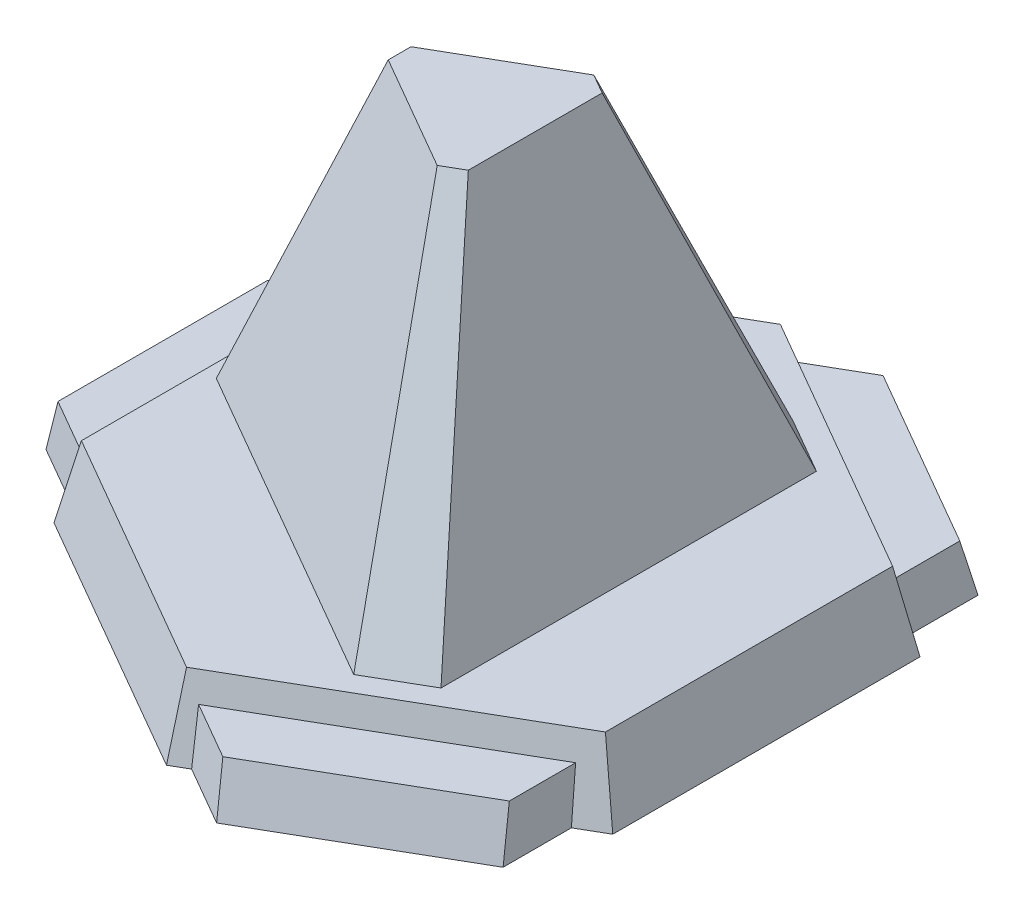
ISO-10303-21;
HEADER;
FILE_DESCRIPTION(('STEP AP214'),'2;1');
FILE_NAME('part.step','',(''),(''),'','','');
FILE_SCHEMA(('AUTOMOTIVE_DESIGN { 1 0 10303 214 1 1 1 1 }'));
ENDSEC;
DATA;
#1=APPLICATION_CONTEXT('core data for automotive mechanical design processes');
#2=APPLICATION_PROTOCOL_DEFINITION('international standard','automotive_design',2000,#1);
#3=PRODUCT_CONTEXT('',#1,'mechanical');
#4=PRODUCT('Part','Part','',(#3));
#5=PRODUCT_RELATED_PRODUCT_CATEGORY('part','',(#4));
#6=PRODUCT_DEFINITION_FORMATION('','',#4);
#7=PRODUCT_DEFINITION_CONTEXT('part definition',#1,'design');
#8=PRODUCT_DEFINITION('design','',#6,#7);
#9=PRODUCT_DEFINITION_SHAPE('','',#8);
#10=(LENGTH_UNIT() NAMED_UNIT(*) SI_UNIT(.MILLI.,.METRE.));
#11=(NAMED_UNIT(*) PLANE_ANGLE_UNIT() SI_UNIT($,.RADIAN.));
#12=(NAMED_UNIT(*) SI_UNIT($,.STERADIAN.) SOLID_ANGLE_UNIT());
#13=UNCERTAINTY_MEASURE_WITH_UNIT(LENGTH_MEASURE(1.E-05),#10,'distance_accuracy_value','');
#14=(GEOMETRIC_REPRESENTATION_CONTEXT(3) GLOBAL_UNCERTAINTY_ASSIGNED_CONTEXT((#13)) GLOBAL_UNIT_ASSIGNED_CONTEXT((#10,
#11,#12)) REPRESENTATION_CONTEXT('',''));
#15=CARTESIAN_POINT('',(0.,0.,0.));
#16=DIRECTION('',(0.,0.,1.));
#17=DIRECTION('',(1.,0.,0.));
#18=AXIS2_PLACEMENT_3D('',#15,#16,#17);
#19=CARTESIAN_POINT('',(0.,200.,0.));
#20=DIRECTION('',(0.,1.,0.));
#21=DIRECTION('',(0.,0.,1.));
#22=AXIS2_PLACEMENT_3D('',#19,#20,#21);
#23=PLANE('',#22);
#24=DIRECTION('',(-0.866021880362492,0.,-0.500006102696171));
#25=VECTOR('',#24,1.);
#26=CARTESIAN_POINT('',(709.540386799793,200.,-383.635));
#27=LINE('',#26,#25);
#28=CARTESIAN_POINT('',(709.540386799793,200.,-383.635));
#29=VERTEX_POINT('',#28);
#30=CARTESIAN_POINT('',(0.,200.,-793.295));
#31=VERTEX_POINT('',#30);
#32=EDGE_CURVE('E689',#29,#31,#27,.T.);
#33=ORIENTED_EDGE('',*,*,#32,.T.);
#34=DIRECTION('',(-0.866021641384725,0.,0.500006516610841));
#35=VECTOR('',#34,1.);
#36=CARTESIAN_POINT('',(0.,200.,-793.295));
#37=LINE('',#36,#35);
#38=CARTESIAN_POINT('',(-664.472424785258,200.,-409.655));
#39=VERTEX_POINT('',#38);
#40=EDGE_CURVE('E670',#31,#39,#37,.T.);
#41=ORIENTED_EDGE('',*,*,#40,.T.);
#42=DIRECTION('',(0.,0.,1.));
#43=VECTOR('',#42,1.);
#44=CARTESIAN_POINT('',(-664.472424785258,200.,-409.655));
#45=LINE('',#44,#43);
#46=CARTESIAN_POINT('',(-664.472424785258,200.,409.655));
#47=VERTEX_POINT('',#46);
#48=EDGE_CURVE('E815',#39,#47,#45,.T.);
#49=ORIENTED_EDGE('',*,*,#48,.T.);
#50=DIRECTION('',(0.866021641384725,0.,0.500006516610841));
#51=VECTOR('',#50,1.);
#52=CARTESIAN_POINT('',(-664.472424785258,200.,409.655));
#53=LINE('',#52,#51);
#54=CARTESIAN_POINT('',(0.,200.,793.295));
#55=VERTEX_POINT('',#54);
#56=EDGE_CURVE('E819',#47,#55,#53,.T.);
#57=ORIENTED_EDGE('',*,*,#56,.T.);
#58=DIRECTION('',(0.866021880362492,0.,-0.500006102696171));
#59=VECTOR('',#58,1.);
#60=CARTESIAN_POINT('',(0.,200.,793.295));
#61=LINE('',#60,#59);
#62=CARTESIAN_POINT('',(709.540386799793,200.,383.635));
#63=VERTEX_POINT('',#62);
#64=EDGE_CURVE('E679',#55,#63,#61,.T.);
#65=ORIENTED_EDGE('',*,*,#64,.T.);
#66=DIRECTION('',(0.,0.,-1.));
#67=VECTOR('',#66,1.);
#68=CARTESIAN_POINT('',(709.540386799793,200.,383.635));
#69=LINE('',#68,#67);
#70=EDGE_CURVE('E675',#63,#29,#69,.T.);
#71=ORIENTED_EDGE('',*,*,#70,.T.);
#72=EDGE_LOOP('',(#33,#41,#49,#57,#65,#71));
#73=FACE_BOUND('',#72,.T.);
#74=DIRECTION('',(0.,0.,1.));
#75=VECTOR('',#74,1.);
#76=CARTESIAN_POINT('',(-628.390648589845,200.,85.3266133395101));
#77=LINE('',#76,#75);
#78=CARTESIAN_POINT('',(-628.390648589845,200.,-85.3333866604898));
#79=VERTEX_POINT('',#78);
#80=CARTESIAN_POINT('',(-628.390648589845,200.,85.3266133395101));
#81=VERTEX_POINT('',#80);
#82=EDGE_CURVE('E349',#79,#81,#77,.T.);
#83=ORIENTED_EDGE('',*,*,#82,.F.);
#84=DIRECTION('',(-0.866024804325613,0.,0.500001038291707));
#85=VECTOR('',#84,1.);
#86=CARTESIAN_POINT('',(-628.390648589845,200.,-85.3333866604898));
#87=LINE('',#86,#85);
#88=CARTESIAN_POINT('',(240.30151213309,200.,-586.874428150135));
#89=VERTEX_POINT('',#88);
#90=EDGE_CURVE('E1160',#89,#79,#87,.T.);
#91=ORIENTED_EDGE('',*,*,#90,.F.);
#92=DIRECTION('',(-0.866025403784436,0.,-0.500000000000004));
#93=VECTOR('',#92,1.);
#94=CARTESIAN_POINT('',(240.30151213309,200.,-586.874428150135));
#95=LINE('',#94,#93);
#96=CARTESIAN_POINT('',(388.097407542942,200.,-501.544428150134));
#97=VERTEX_POINT('',#96);
#98=EDGE_CURVE('E1157',#97,#89,#95,.T.);
#99=ORIENTED_EDGE('',*,*,#98,.F.);
#100=DIRECTION('',(0.,0.,-1.));
#101=VECTOR('',#100,1.);
#102=CARTESIAN_POINT('',(388.097407542942,200.,-501.544428150134));
#103=LINE('',#102,#101);
#104=CARTESIAN_POINT('',(388.097407542942,200.,501.535571849866));
#105=VERTEX_POINT('',#104);
#106=EDGE_CURVE('E255',#105,#97,#103,.T.);
#107=ORIENTED_EDGE('',*,*,#106,.F.);
#108=DIRECTION('',(0.866021880362492,0.,-0.500006102696171));
#109=VECTOR('',#108,1.);
#110=CARTESIAN_POINT('',(388.097407542942,200.,501.535571849866));
#111=LINE('',#110,#109);
#112=CARTESIAN_POINT('',(240.302113440279,200.,586.866613335994));
#113=VERTEX_POINT('',#112);
#114=EDGE_CURVE('E1153',#113,#105,#111,.T.);
#115=ORIENTED_EDGE('',*,*,#114,.F.);
#116=DIRECTION('',(0.866025403786462,0.,0.499999999996495));
#117=VECTOR('',#116,1.);
#118=CARTESIAN_POINT('',(240.302113440279,200.,586.866613335994));
#119=LINE('',#118,#117);
#120=EDGE_CURVE('E1146',#81,#113,#119,.T.);
#121=ORIENTED_EDGE('',*,*,#120,.F.);
#122=EDGE_LOOP('',(#83,#91,#99,#107,#115,#121));
#123=FACE_BOUND('',#122,.T.);
#124=ADVANCED_FACE('F84',(#73,#123),#23,.T.);
#125=CARTESIAN_POINT('',(0.,0.,0.));
#126=DIRECTION('',(0.,1.,0.));
#127=DIRECTION('',(0.,0.,1.));
#128=AXIS2_PLACEMENT_3D('',#125,#126,#127);
#129=PLANE('',#128);
#130=DIRECTION('',(0.866025403784434,0.,0.500000000000008));
#131=VECTOR('',#130,1.);
#132=CARTESIAN_POINT('',(20.0519421003271,0.,809.279324454482));
#133=LINE('',#132,#131);
#134=CARTESIAN_POINT('',(42.5929822518182,0.,822.29340005376));
#135=VERTEX_POINT('',#134);
#136=CARTESIAN_POINT('',(200.609578535344,0.,913.524324454484));
#137=VERTEX_POINT('',#136);
#138=EDGE_CURVE('E573',#135,#137,#133,.T.);
#139=ORIENTED_EDGE('',*,*,#138,.F.);
#140=DIRECTION('',(0.866021880362492,0.,-0.500006102696171));
#141=VECTOR('',#140,1.);
#142=CARTESIAN_POINT('',(-1.28066276541827E-05,0.,846.884877410448));
#143=LINE('',#142,#141);
#144=CARTESIAN_POINT('',(-1.28066276541827E-05,0.,846.884877410448));
#145=VERTEX_POINT('',#144);
#146=EDGE_CURVE('E558',#145,#135,#143,.T.);
#147=ORIENTED_EDGE('',*,*,#146,.F.);
#148=DIRECTION('',(0.866021641384725,0.,0.500006516610841));
#149=VECTOR('',#148,1.);
#150=CARTESIAN_POINT('',(-710.882424785258,0.,436.449593177819));
#151=LINE('',#150,#149);
#152=CARTESIAN_POINT('',(-710.882424785258,0.,436.449593177819));
#153=VERTEX_POINT('',#152);
#154=EDGE_CURVE('E559',#153,#145,#151,.T.);
#155=ORIENTED_EDGE('',*,*,#154,.F.);
#156=DIRECTION('',(0.,0.,1.));
#157=VECTOR('',#156,1.);
#158=CARTESIAN_POINT('',(-710.882424785258,0.,-436.449593177819));
#159=LINE('',#158,#157);
#160=CARTESIAN_POINT('',(-710.882424785258,0.,381.545829026863));
#161=VERTEX_POINT('',#160);
#162=EDGE_CURVE('E638',#161,#153,#159,.T.);
#163=ORIENTED_EDGE('',*,*,#162,.F.);
#164=DIRECTION('',(0.866025403784439,0.,0.5));
#165=VECTOR('',#164,1.);
#166=CARTESIAN_POINT('',(-891.440061220275,0.,277.300829026863));
#167=LINE('',#166,#165);
#168=CARTESIAN_POINT('',(-891.440061220275,0.,277.300829026863));
#169=VERTEX_POINT('',#168);
#170=EDGE_CURVE('E913',#169,#161,#167,.T.);
#171=ORIENTED_EDGE('',*,*,#170,.F.);
#172=DIRECTION('',(0.,0.,1.));
#173=VECTOR('',#172,1.);
#174=CARTESIAN_POINT('',(-891.440061220275,0.,-283.029170973137));
#175=LINE('',#174,#173);
#176=CARTESIAN_POINT('',(-891.440061220275,0.,-283.029170973137));
#177=VERTEX_POINT('',#176);
#178=EDGE_CURVE('E919',#177,#169,#175,.T.);
#179=ORIENTED_EDGE('',*,*,#178,.F.);
#180=DIRECTION('',(-0.866025403784439,0.,0.5));
#181=VECTOR('',#180,1.);
#182=CARTESIAN_POINT('',(-710.882424785258,0.,-387.274170973137));
#183=LINE('',#182,#181);
#184=CARTESIAN_POINT('',(-710.882424785258,0.,-387.274170973137));
#185=VERTEX_POINT('',#184);
#186=EDGE_CURVE('E915',#185,#177,#183,.T.);
#187=ORIENTED_EDGE('',*,*,#186,.F.);
#188=CARTESIAN_POINT('',(-710.882424785258,0.,-436.449593177819));
#189=VERTEX_POINT('',#188);
#190=EDGE_CURVE('E646',#189,#185,#159,.T.);
#191=ORIENTED_EDGE('',*,*,#190,.F.);
#192=DIRECTION('',(-0.866021641384725,0.,0.500006516610841));
#193=VECTOR('',#192,1.);
#194=CARTESIAN_POINT('',(-1.28066275431604E-05,0.,-846.884877410448));
#195=LINE('',#194,#193);
#196=CARTESIAN_POINT('',(-1.28066275431604E-05,0.,-846.884877410448));
#197=VERTEX_POINT('',#196);
#198=EDGE_CURVE('E632',#197,#189,#195,.T.);
#199=ORIENTED_EDGE('',*,*,#198,.F.);
#200=DIRECTION('',(-0.866021880362492,0.,-0.500006102696171));
#201=VECTOR('',#200,1.);
#202=CARTESIAN_POINT('',(755.950386799793,0.,-410.429607965514));
#203=LINE('',#202,#201);
#204=CARTESIAN_POINT('',(47.55383153254,0.,-819.429205775114));
#205=VERTEX_POINT('',#204);
#206=EDGE_CURVE('E620',#205,#197,#203,.T.);
#207=ORIENTED_EDGE('',*,*,#206,.F.);
#208=DIRECTION('',(-0.866025403784441,0.,0.499999999999996));
#209=VECTOR('',#208,1.);
#210=CARTESIAN_POINT('',(205.570468182393,0.,-910.660153481345));
#211=LINE('',#210,#209);
#212=CARTESIAN_POINT('',(205.570468182393,0.,-910.660153481345));
#213=VERTEX_POINT('',#212);
#214=EDGE_CURVE('E625',#213,#205,#211,.T.);
#215=ORIENTED_EDGE('',*,*,#214,.F.);
#216=DIRECTION('',(-0.866025403784436,0.,-0.500000000000004));
#217=VECTOR('',#216,1.);
#218=CARTESIAN_POINT('',(690.830482684926,0.,-630.495153481342));
#219=LINE('',#218,#217);
#220=CARTESIAN_POINT('',(690.830482684926,0.,-630.495153481342));
#221=VERTEX_POINT('',#220);
#222=EDGE_CURVE('E1000',#221,#213,#219,.T.);
#223=ORIENTED_EDGE('',*,*,#222,.F.);
#224=DIRECTION('',(0.,0.,-1.));
#225=VECTOR('',#224,1.);
#226=CARTESIAN_POINT('',(690.830482684925,0.,-422.005153481342));
#227=LINE('',#226,#225);
#228=CARTESIAN_POINT('',(690.830482684925,0.,-448.027213987656));
#229=VERTEX_POINT('',#228);
#230=EDGE_CURVE('E594',#229,#221,#227,.T.);
#231=ORIENTED_EDGE('',*,*,#230,.F.);
#232=CARTESIAN_POINT('',(755.950386799793,0.,-410.429607965514));
#233=VERTEX_POINT('',#232);
#234=EDGE_CURVE('E623',#233,#229,#203,.T.);
#235=ORIENTED_EDGE('',*,*,#234,.F.);
#236=DIRECTION('',(0.,0.,-1.));
#237=VECTOR('',#236,1.);
#238=CARTESIAN_POINT('',(755.950386799793,0.,410.429607965515));
#239=LINE('',#238,#237);
#240=CARTESIAN_POINT('',(755.950386799793,0.,410.429607965515));
#241=VERTEX_POINT('',#240);
#242=EDGE_CURVE('E568',#241,#233,#239,.T.);
#243=ORIENTED_EDGE('',*,*,#242,.F.);
#244=CARTESIAN_POINT('',(685.869593037883,0.,450.891431572188));
#245=VERTEX_POINT('',#244);
#246=EDGE_CURVE('E555',#245,#241,#143,.T.);
#247=ORIENTED_EDGE('',*,*,#246,.F.);
#248=DIRECTION('',(0.,0.,-1.));
#249=VECTOR('',#248,1.);
#250=CARTESIAN_POINT('',(685.869593037881,0.,633.359324454488));
#251=LINE('',#250,#249);
#252=CARTESIAN_POINT('',(685.869593037881,0.,633.359324454488));
#253=VERTEX_POINT('',#252);
#254=EDGE_CURVE('E560',#253,#245,#251,.T.);
#255=ORIENTED_EDGE('',*,*,#254,.F.);
#256=DIRECTION('',(0.866025403784443,0.,-0.499999999999992));
#257=VECTOR('',#256,1.);
#258=CARTESIAN_POINT('',(200.609578535344,0.,913.524324454484));
#259=LINE('',#258,#257);
#260=EDGE_CURVE('E529',#137,#253,#259,.T.);
#261=ORIENTED_EDGE('',*,*,#260,.F.);
#262=EDGE_LOOP('',(#139,#147,#155,#163,#171,#179,#187,#191,#199,#207,#215,#223,#231,#235,#243,
#247,#255,#261));
#263=FACE_BOUND('',#262,.T.);
#264=ADVANCED_FACE('F86',(#263),#129,.F.);
#265=CARTESIAN_POINT('',(-347.97748435265,161.494245697761,-602.704209150453));
#266=DIRECTION('',(-0.487064908399797,0.226043877908375,-0.843606507955955));
#267=DIRECTION('',(-0.866021641384725,0.,0.500006516610841));
#268=AXIS2_PLACEMENT_3D('',#265,#266,#267);
#269=PLANE('',#268);
#270=DIRECTION('',(-6.18512586886278E-08,-0.965925779291661,-0.25881922049916));
#271=VECTOR('',#270,1.);
#272=CARTESIAN_POINT('',(0.,200.,-793.295));
#273=LINE('',#272,#271);
#274=EDGE_CURVE('E667',#31,#197,#273,.T.);
#275=ORIENTED_EDGE('',*,*,#274,.T.);
#276=ORIENTED_EDGE('',*,*,#198,.T.);
#277=DIRECTION('',(-0.224143172858408,-0.965926192020722,-0.129407996774977));
#278=VECTOR('',#277,1.);
#279=CARTESIAN_POINT('',(-664.472424785258,200.,-409.655));
#280=LINE('',#279,#278);
#281=EDGE_CURVE('E674',#39,#189,#280,.T.);
#282=ORIENTED_EDGE('',*,*,#281,.F.);
#283=ORIENTED_EDGE('',*,*,#40,.F.);
#284=EDGE_LOOP('',(#275,#276,#282,#283));
#285=FACE_BOUND('',#284,.T.);
#286=ADVANCED_FACE('F668',(#285),#269,.T.);
#287=CARTESIAN_POINT('',(-674.559293888962,156.531484146933,0.));
#288=DIRECTION('',(-0.974117120915213,0.226043877908375,0.));
#289=DIRECTION('',(-0.226043877908375,-0.974117120915213,0.));
#290=AXIS2_PLACEMENT_3D('',#287,#288,#289);
#291=PLANE('',#290);
#292=DIRECTION('',(-0.225848374170278,-0.973274613963708,-0.0415816990806911));
#293=VECTOR('',#292,1.);
#294=CARTESIAN_POINT('',(-670.985144584048,171.933980612842,-379.928549356158));
#295=LINE('',#294,#293);
#296=CARTESIAN_POINT('',(-680.697360785258,130.08,-381.716697944647));
#297=VERTEX_POINT('',#296);
#298=EDGE_CURVE('E980',#297,#185,#295,.T.);
#299=ORIENTED_EDGE('',*,*,#298,.F.);
#300=DIRECTION('',(0.,0.,1.));
#301=VECTOR('',#300,1.);
#302=CARTESIAN_POINT('',(-680.697360785258,130.08,0.));
#303=LINE('',#302,#301);
#304=CARTESIAN_POINT('',(-680.697360785258,130.08,381.716697944648));
#305=VERTEX_POINT('',#304);
#306=EDGE_CURVE('E983',#297,#305,#303,.T.);
#307=ORIENTED_EDGE('',*,*,#306,.T.);
#308=DIRECTION('',(0.226043692858134,0.974116323456731,0.00127956797343759));
#309=VECTOR('',#308,1.);
#310=CARTESIAN_POINT('',(-674.669711016119,156.055650804305,381.750818726794));
#311=LINE('',#310,#309);
#312=EDGE_CURVE('E987',#161,#305,#311,.T.);
#313=ORIENTED_EDGE('',*,*,#312,.F.);
#314=ORIENTED_EDGE('',*,*,#162,.T.);
#315=DIRECTION('',(-0.224143172858408,-0.965926192020722,0.129407996774976));
#316=VECTOR('',#315,1.);
#317=CARTESIAN_POINT('',(-664.472424785258,200.,409.655));
#318=LINE('',#317,#316);
#319=EDGE_CURVE('E624',#47,#153,#318,.T.);
#320=ORIENTED_EDGE('',*,*,#319,.F.);
#321=ORIENTED_EDGE('',*,*,#48,.F.);
#322=ORIENTED_EDGE('',*,*,#281,.T.);
#323=ORIENTED_EDGE('',*,*,#190,.T.);
#324=EDGE_LOOP('',(#299,#307,#313,#314,#320,#321,#322,#323));
#325=FACE_BOUND('',#324,.T.);
#326=ADVANCED_FACE('F708',(#325),#291,.T.);
#327=CARTESIAN_POINT('',(347.977286238095,161.494287441961,-602.704531257433));
#328=DIRECTION('',(0.487064505198431,0.226043877908375,-0.843606740748289));
#329=DIRECTION('',(-0.866021880362492,0.,-0.500006102696171));
#330=AXIS2_PLACEMENT_3D('',#327,#328,#329);
#331=PLANE('',#330);
#332=DIRECTION('',(0.148935003629873,-0.973274671525254,-0.174799251889639));
#333=VECTOR('',#332,1.);
#334=CARTESIAN_POINT('',(663.842914585872,176.360934882354,-416.352949381878));
#335=LINE('',#334,#333);
#336=CARTESIAN_POINT('',(670.925037861407,130.08,-424.664963483211));
#337=VERTEX_POINT('',#336);
#338=EDGE_CURVE('E1100',#337,#229,#335,.T.);
#339=ORIENTED_EDGE('',*,*,#338,.F.);
#340=DIRECTION('',(-0.866021880362492,0.,-0.500006102696171));
#341=VECTOR('',#340,1.);
#342=CARTESIAN_POINT('',(351.622173425283,130.08,-609.017558315577));
#343=LINE('',#342,#341);
#344=CARTESIAN_POINT('',(32.3133239123465,130.08,-793.373608689887));
#345=VERTEX_POINT('',#344);
#346=EDGE_CURVE('E1081',#337,#345,#343,.T.);
#347=ORIENTED_EDGE('',*,*,#346,.T.);
#348=DIRECTION('',(-0.114129976021957,0.97411632544742,0.19511979158979));
#349=VECTOR('',#348,1.);
#350=CARTESIAN_POINT('',(28.6865288742119,161.035235240031,-787.173138693787));
#351=LINE('',#350,#349);
#352=EDGE_CURVE('E732',#205,#345,#351,.T.);
#353=ORIENTED_EDGE('',*,*,#352,.F.);
#354=ORIENTED_EDGE('',*,*,#206,.T.);
#355=ORIENTED_EDGE('',*,*,#274,.F.);
#356=ORIENTED_EDGE('',*,*,#32,.F.);
#357=DIRECTION('',(0.224143170786831,-0.965926183093433,-0.129408066998072));
#358=VECTOR('',#357,1.);
#359=CARTESIAN_POINT('',(709.540386799793,200.,-383.635));
#360=LINE('',#359,#358);
#361=EDGE_CURVE('E677',#29,#233,#360,.T.);
#362=ORIENTED_EDGE('',*,*,#361,.T.);
#363=ORIENTED_EDGE('',*,*,#234,.T.);
#364=EDGE_LOOP('',(#339,#347,#353,#354,#355,#356,#362,#363));
#365=FACE_BOUND('',#364,.T.);
#366=ADVANCED_FACE('F697',(#365),#331,.T.);
#367=CARTESIAN_POINT('',(717.32447076434,166.455143440865,0.));
#368=DIRECTION('',(0.974117120915213,0.226043877908375,0.));
#369=DIRECTION('',(-0.226043877908375,0.974117120915213,0.));
#370=AXIS2_PLACEMENT_3D('',#367,#368,#369);
#371=PLANE('',#370);
#372=DIRECTION('',(0.224143170786831,-0.965926183093433,0.129408066998072));
#373=VECTOR('',#372,1.);
#374=CARTESIAN_POINT('',(709.540386799793,200.,383.635));
#375=LINE('',#374,#373);
#376=EDGE_CURVE('E996',#63,#241,#375,.T.);
#377=ORIENTED_EDGE('',*,*,#376,.T.);
#378=ORIENTED_EDGE('',*,*,#242,.T.);
#379=ORIENTED_EDGE('',*,*,#361,.F.);
#380=ORIENTED_EDGE('',*,*,#70,.F.);
#381=EDGE_LOOP('',(#377,#378,#379,#380));
#382=FACE_BOUND('',#381,.T.);
#383=ADVANCED_FACE('F707',(#382),#371,.T.);
#384=CARTESIAN_POINT('',(347.977286238095,161.49428744196,602.704531257433));
#385=DIRECTION('',(0.48706450519843,0.226043877908375,0.843606740748289));
#386=DIRECTION('',(0.866021880362492,0.,-0.500006102696171));
#387=AXIS2_PLACEMENT_3D('',#384,#385,#386);
#388=PLANE('',#387);
#389=DIRECTION('',(0.076913667822124,-0.973274556400325,0.216381435354094));
#390=VECTOR('',#389,1.);
#391=CARTESIAN_POINT('',(28.6558404069379,176.362224434997,783.084000183464));
#392=LINE('',#391,#390);
#393=CARTESIAN_POINT('',(32.3133239123409,130.08,793.37360868989));
#394=VERTEX_POINT('',#393);
#395=EDGE_CURVE('E12',#394,#135,#392,.T.);
#396=ORIENTED_EDGE('',*,*,#395,.F.);
#397=DIRECTION('',(0.866021880362492,0.,-0.500006102696171));
#398=VECTOR('',#397,1.);
#399=CARTESIAN_POINT('',(351.622173425283,130.08,609.017558315578));
#400=LINE('',#399,#398);
#401=CARTESIAN_POINT('',(670.925037861401,130.08,424.664963483215));
#402=VERTEX_POINT('',#401);
#403=EDGE_CURVE('E94',#394,#402,#400,.T.);
#404=ORIENTED_EDGE('',*,*,#403,.T.);
#405=DIRECTION('',(-0.111913707829207,0.974116321463546,-0.196399374383546));
#406=VECTOR('',#405,1.);
#407=CARTESIAN_POINT('',(667.368801772061,161.034095658148,418.424060946304));
#408=LINE('',#407,#406);
#409=EDGE_CURVE('E889',#245,#402,#408,.T.);
#410=ORIENTED_EDGE('',*,*,#409,.F.);
#411=ORIENTED_EDGE('',*,*,#246,.T.);
#412=ORIENTED_EDGE('',*,*,#376,.F.);
#413=ORIENTED_EDGE('',*,*,#64,.F.);
#414=DIRECTION('',(-6.18512587448216E-08,-0.965925779291661,0.25881922049916));
#415=VECTOR('',#414,1.);
#416=CARTESIAN_POINT('',(0.,200.,793.295));
#417=LINE('',#416,#415);
#418=EDGE_CURVE('E841',#55,#145,#417,.T.);
#419=ORIENTED_EDGE('',*,*,#418,.T.);
#420=ORIENTED_EDGE('',*,*,#146,.T.);
#421=EDGE_LOOP('',(#396,#404,#410,#411,#412,#413,#419,#420));
#422=FACE_BOUND('',#421,.T.);
#423=ADVANCED_FACE('F855',(#422),#388,.T.);
#424=CARTESIAN_POINT('',(-347.977484352651,161.49424569776,602.704209150453));
#425=DIRECTION('',(-0.487064908399797,0.226043877908375,0.843606507955955));
#426=DIRECTION('',(0.866021641384725,0.,0.500006516610841));
#427=AXIS2_PLACEMENT_3D('',#424,#425,#426);
#428=PLANE('',#427);
#429=ORIENTED_EDGE('',*,*,#319,.T.);
#430=ORIENTED_EDGE('',*,*,#154,.T.);
#431=ORIENTED_EDGE('',*,*,#418,.F.);
#432=ORIENTED_EDGE('',*,*,#56,.F.);
#433=EDGE_LOOP('',(#429,#430,#431,#432));
#434=FACE_BOUND('',#433,.T.);
#435=ADVANCED_FACE('F846',(#434),#428,.T.);
#436=CARTESIAN_POINT('',(0.,130.08,0.));
#437=DIRECTION('',(0.,-1.,0.));
#438=DIRECTION('',(0.,0.,-1.));
#439=AXIS2_PLACEMENT_3D('',#436,#437,#438);
#440=PLANE('',#439);
#441=ORIENTED_EDGE('',*,*,#306,.F.);
#442=DIRECTION('',(-0.866025403784439,0.,0.499999999999999));
#443=VECTOR('',#442,1.);
#444=CARTESIAN_POINT('',(-856.590061220275,130.08,-280.165));
#445=LINE('',#444,#443);
#446=CARTESIAN_POINT('',(-856.590061220275,130.08,-280.165));
#447=VERTEX_POINT('',#446);
#448=EDGE_CURVE('E921',#297,#447,#445,.T.);
#449=ORIENTED_EDGE('',*,*,#448,.T.);
#450=DIRECTION('',(0.,0.,1.));
#451=VECTOR('',#450,1.);
#452=CARTESIAN_POINT('',(-856.590061220275,130.08,280.165));
#453=LINE('',#452,#451);
#454=CARTESIAN_POINT('',(-856.590061220275,130.08,280.165));
#455=VERTEX_POINT('',#454);
#456=EDGE_CURVE('E973',#447,#455,#453,.T.);
#457=ORIENTED_EDGE('',*,*,#456,.T.);
#458=DIRECTION('',(0.866025403784438,0.,0.5));
#459=VECTOR('',#458,1.);
#460=CARTESIAN_POINT('',(-676.032424785258,130.08,384.41));
#461=LINE('',#460,#459);
#462=EDGE_CURVE('E975',#455,#305,#461,.T.);
#463=ORIENTED_EDGE('',*,*,#462,.T.);
#464=EDGE_LOOP('',(#441,#449,#457,#463));
#465=FACE_BOUND('',#464,.T.);
#466=ADVANCED_FACE('F854',(#465),#440,.F.);
#467=CARTESIAN_POINT('',(-337.511881005598,103.295266368985,-584.587726059837));
#468=DIRECTION('',(-0.494246711773971,0.151263847638716,-0.856060416266369));
#469=DIRECTION('',(-0.866025403784439,0.,0.5));
#470=AXIS2_PLACEMENT_3D('',#467,#468,#469);
#471=PLANE('',#470);
#472=ORIENTED_EDGE('',*,*,#448,.F.);
#473=ORIENTED_EDGE('',*,*,#298,.T.);
#474=ORIENTED_EDGE('',*,*,#186,.T.);
#475=DIRECTION('',(-0.258727064120978,-0.965716398876813,-0.0212636598857994));
#476=VECTOR('',#475,1.);
#477=CARTESIAN_POINT('',(-856.590061220275,130.08,-280.165));
#478=LINE('',#477,#476);
#479=EDGE_CURVE('E1241',#447,#177,#478,.T.);
#480=ORIENTED_EDGE('',*,*,#479,.F.);
#481=EDGE_LOOP('',(#472,#473,#474,#480));
#482=FACE_BOUND('',#481,.T.);
#483=ADVANCED_FACE('F955',(#482),#471,.T.);
#484=CARTESIAN_POINT('',(-831.740343739364,222.833263986138,0.));
#485=DIRECTION('',(-0.965934794005779,0.25878557480859,0.));
#486=DIRECTION('',(-0.25878557480859,-0.96593479400578,0.));
#487=AXIS2_PLACEMENT_3D('',#484,#485,#486);
#488=PLANE('',#487);
#489=ORIENTED_EDGE('',*,*,#479,.T.);
#490=ORIENTED_EDGE('',*,*,#178,.T.);
#491=DIRECTION('',(-0.258727064120979,-0.965716398876813,-0.0212636598857994));
#492=VECTOR('',#491,1.);
#493=CARTESIAN_POINT('',(-856.590061220275,130.08,280.165));
#494=LINE('',#493,#492);
#495=EDGE_CURVE('E920',#455,#169,#494,.T.);
#496=ORIENTED_EDGE('',*,*,#495,.F.);
#497=ORIENTED_EDGE('',*,*,#456,.F.);
#498=EDGE_LOOP('',(#489,#490,#496,#497));
#499=FACE_BOUND('',#498,.T.);
#500=ADVANCED_FACE('F1227',(#499),#488,.T.);
#501=CARTESIAN_POINT('',(-338.467326159904,77.7712735429424,586.24260561094));
#502=DIRECTION('',(-0.496732530805441,0.114136634602943,0.860365981127297));
#503=DIRECTION('',(0.866025403784439,0.,0.5));
#504=AXIS2_PLACEMENT_3D('',#501,#502,#503);
#505=PLANE('',#504);
#506=ORIENTED_EDGE('',*,*,#170,.T.);
#507=ORIENTED_EDGE('',*,*,#312,.T.);
#508=ORIENTED_EDGE('',*,*,#462,.F.);
#509=ORIENTED_EDGE('',*,*,#495,.T.);
#510=EDGE_LOOP('',(#506,#507,#508,#509));
#511=FACE_BOUND('',#510,.T.);
#512=ADVANCED_FACE('F775',(#511),#505,.T.);
#513=CARTESIAN_POINT('',(0.,130.08,0.));
#514=DIRECTION('',(0.,-1.,0.));
#515=DIRECTION('',(0.866025403784436,0.,0.500000000000004));
#516=AXIS2_PLACEMENT_3D('',#513,#514,#515);
#517=PLANE('',#516);
#518=ORIENTED_EDGE('',*,*,#346,.F.);
#519=DIRECTION('',(0.,0.,-1.));
#520=VECTOR('',#519,1.);
#521=CARTESIAN_POINT('',(670.925037861408,130.08,-601.746253646023));
#522=LINE('',#521,#520);
#523=CARTESIAN_POINT('',(670.925037861408,130.08,-601.746253646023));
#524=VERTEX_POINT('',#523);
#525=EDGE_CURVE('E580',#337,#524,#522,.T.);
#526=ORIENTED_EDGE('',*,*,#525,.T.);
#527=DIRECTION('',(-0.866025403784437,0.,-0.500000000000004));
#528=VECTOR('',#527,1.);
#529=CARTESIAN_POINT('',(185.665023358875,130.08,-881.911253646025));
#530=LINE('',#529,#528);
#531=CARTESIAN_POINT('',(185.665023358875,130.08,-881.911253646025));
#532=VERTEX_POINT('',#531);
#533=EDGE_CURVE('E589',#524,#532,#530,.T.);
#534=ORIENTED_EDGE('',*,*,#533,.T.);
#535=DIRECTION('',(-0.866025403784441,0.,0.499999999999996));
#536=VECTOR('',#535,1.);
#537=CARTESIAN_POINT('',(5.10738692385632,130.08,-777.666253646026));
#538=LINE('',#537,#536);
#539=EDGE_CURVE('E581',#532,#345,#538,.T.);
#540=ORIENTED_EDGE('',*,*,#539,.T.);
#541=EDGE_LOOP('',(#518,#526,#534,#540));
#542=FACE_BOUND('',#541,.T.);
#543=ADVANCED_FACE('F512',(#542),#517,.F.);
#544=CARTESIAN_POINT('',(675.023762011196,103.295266368985,2.99760216648792E-12));
#545=DIRECTION('',(0.988493423547942,0.151263847638716,0.));
#546=DIRECTION('',(0.,0.,-1.));
#547=AXIS2_PLACEMENT_3D('',#544,#545,#546);
#548=PLANE('',#547);
#549=ORIENTED_EDGE('',*,*,#525,.F.);
#550=ORIENTED_EDGE('',*,*,#338,.T.);
#551=ORIENTED_EDGE('',*,*,#230,.T.);
#552=DIRECTION('',(0.147778401699025,-0.965716398876813,-0.213432380232432));
#553=VECTOR('',#552,1.);
#554=CARTESIAN_POINT('',(670.925037861408,130.08,-601.746253646023));
#555=LINE('',#554,#553);
#556=EDGE_CURVE('E1023',#524,#221,#555,.T.);
#557=ORIENTED_EDGE('',*,*,#556,.F.);
#558=EDGE_LOOP('',(#549,#550,#551,#557));
#559=FACE_BOUND('',#558,.T.);
#560=ADVANCED_FACE('F1038',(#559),#548,.T.);
#561=CARTESIAN_POINT('',(415.870171869686,222.833263986138,-720.308267030689));
#562=DIRECTION('',(0.482967397002894,0.25878557480859,-0.836524070008292));
#563=DIRECTION('',(0.129392787404296,-0.96593479400578,-0.224114881917197));
#564=AXIS2_PLACEMENT_3D('',#561,#562,#563);
#565=PLANE('',#564);
#566=ORIENTED_EDGE('',*,*,#556,.T.);
#567=ORIENTED_EDGE('',*,*,#222,.T.);
#568=DIRECTION('',(0.147778401699025,-0.965716398876813,-0.213432380232433));
#569=VECTOR('',#568,1.);
#570=CARTESIAN_POINT('',(185.665023358875,130.08,-881.911253646025));
#571=LINE('',#570,#569);
#572=EDGE_CURVE('E1005',#532,#213,#571,.T.);
#573=ORIENTED_EDGE('',*,*,#572,.F.);
#574=ORIENTED_EDGE('',*,*,#533,.F.);
#575=EDGE_LOOP('',(#566,#567,#573,#574));
#576=FACE_BOUND('',#575,.T.);
#577=ADVANCED_FACE('F1046',(#576),#565,.T.);
#578=CARTESIAN_POINT('',(-338.467326159901,77.7712735429424,-586.242605610941));
#579=DIRECTION('',(-0.496732530805438,0.114136634602943,-0.860365981127299));
#580=DIRECTION('',(-0.866025403784441,0.,0.499999999999996));
#581=AXIS2_PLACEMENT_3D('',#578,#579,#580);
#582=PLANE('',#581);
#583=ORIENTED_EDGE('',*,*,#214,.T.);
#584=ORIENTED_EDGE('',*,*,#352,.T.);
#585=ORIENTED_EDGE('',*,*,#539,.F.);
#586=ORIENTED_EDGE('',*,*,#572,.T.);
#587=EDGE_LOOP('',(#583,#584,#585,#586));
#588=FACE_BOUND('',#587,.T.);
#589=ADVANCED_FACE('F432',(#588),#582,.T.);
#590=CARTESIAN_POINT('',(0.,130.08,0.));
#591=DIRECTION('',(0.,-1.,0.));
#592=DIRECTION('',(-0.866025403784443,0.,0.499999999999992));
#593=AXIS2_PLACEMENT_3D('',#590,#591,#592);
#594=PLANE('',#593);
#595=ORIENTED_EDGE('',*,*,#403,.F.);
#596=DIRECTION('',(0.866025403784433,0.,0.500000000000009));
#597=VECTOR('',#596,1.);
#598=CARTESIAN_POINT('',(185.665023358862,130.08,881.911253646028));
#599=LINE('',#598,#597);
#600=CARTESIAN_POINT('',(185.665023358862,130.08,881.911253646028));
#601=VERTEX_POINT('',#600);
#602=EDGE_CURVE('E469',#394,#601,#599,.T.);
#603=ORIENTED_EDGE('',*,*,#602,.T.);
#604=DIRECTION('',(0.866025403784443,0.,-0.499999999999992));
#605=VECTOR('',#604,1.);
#606=CARTESIAN_POINT('',(670.925037861399,130.08,601.746253646032));
#607=LINE('',#606,#605);
#608=CARTESIAN_POINT('',(670.925037861399,130.08,601.746253646032));
#609=VERTEX_POINT('',#608);
#610=EDGE_CURVE('E548',#601,#609,#607,.T.);
#611=ORIENTED_EDGE('',*,*,#610,.T.);
#612=DIRECTION('',(0.,0.,-1.));
#613=VECTOR('',#612,1.);
#614=CARTESIAN_POINT('',(670.925037861401,130.08,393.256253646032));
#615=LINE('',#614,#613);
#616=EDGE_CURVE('E494',#609,#402,#615,.T.);
#617=ORIENTED_EDGE('',*,*,#616,.T.);
#618=EDGE_LOOP('',(#595,#603,#611,#617));
#619=FACE_BOUND('',#618,.T.);
#620=ADVANCED_FACE('F427',(#619),#594,.F.);
#621=CARTESIAN_POINT('',(-337.511881005603,103.295266368985,584.587726059834));
#622=DIRECTION('',(-0.494246711773979,0.151263847638716,0.856060416266364));
#623=DIRECTION('',(0.866025403784434,0.,0.500000000000008));
#624=AXIS2_PLACEMENT_3D('',#621,#622,#623);
#625=PLANE('',#624);
#626=ORIENTED_EDGE('',*,*,#602,.F.);
#627=ORIENTED_EDGE('',*,*,#395,.T.);
#628=ORIENTED_EDGE('',*,*,#138,.T.);
#629=DIRECTION('',(0.110948662421953,-0.965716398876813,0.234696040118233));
#630=VECTOR('',#629,1.);
#631=CARTESIAN_POINT('',(185.665023358862,130.08,881.911253646028));
#632=LINE('',#631,#630);
#633=EDGE_CURVE('E549',#601,#137,#632,.T.);
#634=ORIENTED_EDGE('',*,*,#633,.F.);
#635=EDGE_LOOP('',(#626,#627,#628,#634));
#636=FACE_BOUND('',#635,.T.);
#637=ADVANCED_FACE('F431',(#636),#625,.T.);
#638=CARTESIAN_POINT('',(415.870171869675,222.833263986138,720.308267030695));
#639=DIRECTION('',(0.482967397002882,0.25878557480859,0.836524070008298));
#640=DIRECTION('',(0.129392787404293,-0.96593479400578,0.224114881917198));
#641=AXIS2_PLACEMENT_3D('',#638,#639,#640);
#642=PLANE('',#641);
#643=ORIENTED_EDGE('',*,*,#633,.T.);
#644=ORIENTED_EDGE('',*,*,#260,.T.);
#645=DIRECTION('',(0.110948662421953,-0.965716398876813,0.234696040118234));
#646=VECTOR('',#645,1.);
#647=CARTESIAN_POINT('',(670.925037861399,130.08,601.746253646032));
#648=LINE('',#647,#646);
#649=EDGE_CURVE('E576',#609,#253,#648,.T.);
#650=ORIENTED_EDGE('',*,*,#649,.F.);
#651=ORIENTED_EDGE('',*,*,#610,.F.);
#652=EDGE_LOOP('',(#643,#644,#650,#651));
#653=FACE_BOUND('',#652,.T.);
#654=ADVANCED_FACE('F510',(#653),#642,.T.);
#655=CARTESIAN_POINT('',(676.934652319807,77.7712735429424,6.16173778666962E-12));
#656=DIRECTION('',(0.993465061610882,0.114136634602943,0.));
#657=DIRECTION('',(0.,0.,-1.));
#658=AXIS2_PLACEMENT_3D('',#655,#656,#657);
#659=PLANE('',#658);
#660=ORIENTED_EDGE('',*,*,#254,.T.);
#661=ORIENTED_EDGE('',*,*,#409,.T.);
#662=ORIENTED_EDGE('',*,*,#616,.F.);
#663=ORIENTED_EDGE('',*,*,#649,.T.);
#664=EDGE_LOOP('',(#660,#661,#662,#663));
#665=FACE_BOUND('',#664,.T.);
#666=ADVANCED_FACE('F296',(#665),#659,.T.);
#667=CARTESIAN_POINT('',(0.,1111.8,0.));
#668=DIRECTION('',(0.,1.,0.));
#669=DIRECTION('',(0.,0.,1.));
#670=AXIS2_PLACEMENT_3D('',#667,#668,#669);
#671=PLANE('',#670);
#672=DIRECTION('',(-0.866024804325612,0.,0.500001038291707));
#673=VECTOR('',#672,1.);
#674=CARTESIAN_POINT('',(85.6536488746759,1111.8,-209.186685053344));
#675=LINE('',#674,#673);
#676=CARTESIAN_POINT('',(85.6536488746759,1111.8,-209.186685053344));
#677=VERTEX_POINT('',#676);
#678=CARTESIAN_POINT('',(-223.984859663904,1111.8,-30.4163138225274));
#679=VERTEX_POINT('',#678);
#680=EDGE_CURVE('E333',#677,#679,#675,.T.);
#681=ORIENTED_EDGE('',*,*,#680,.T.);
#682=DIRECTION('',(0.,0.,1.));
#683=VECTOR('',#682,1.);
#684=CARTESIAN_POINT('',(-223.984859663904,1111.8,-30.4163138225274));
#685=LINE('',#684,#683);
#686=CARTESIAN_POINT('',(-223.984859663904,1111.8,30.4138995237066));
#687=VERTEX_POINT('',#686);
#688=EDGE_CURVE('E325',#679,#687,#685,.T.);
#689=ORIENTED_EDGE('',*,*,#688,.T.);
#690=DIRECTION('',(0.866025403784439,0.,0.5));
#691=VECTOR('',#690,1.);
#692=CARTESIAN_POINT('',(-223.984859663904,1111.8,30.4138995237067));
#693=LINE('',#692,#691);
#694=CARTESIAN_POINT('',(85.6538632051847,1111.8,209.183899523707));
#695=VERTEX_POINT('',#694);
#696=EDGE_CURVE('E332',#687,#695,#693,.T.);
#697=ORIENTED_EDGE('',*,*,#696,.T.);
#698=DIRECTION('',(0.866021880362492,0.,-0.500006102696172));
#699=VECTOR('',#698,1.);
#700=CARTESIAN_POINT('',(85.6538632051847,1111.8,209.183899523707));
#701=LINE('',#700,#699);
#702=CARTESIAN_POINT('',(138.334158952313,1111.8,178.768421621026));
#703=VERTEX_POINT('',#702);
#704=EDGE_CURVE('E276',#695,#703,#701,.T.);
#705=ORIENTED_EDGE('',*,*,#704,.T.);
#706=DIRECTION('',(0.,0.,-1.));
#707=VECTOR('',#706,1.);
#708=CARTESIAN_POINT('',(138.334158952313,1111.8,178.768421621026));
#709=LINE('',#708,#707);
#710=CARTESIAN_POINT('',(138.334158952313,1111.8,-178.771578378974));
#711=VERTEX_POINT('',#710);
#712=EDGE_CURVE('E251',#703,#711,#709,.T.);
#713=ORIENTED_EDGE('',*,*,#712,.T.);
#714=DIRECTION('',(-0.866025403784439,0.,-0.5));
#715=VECTOR('',#714,1.);
#716=CARTESIAN_POINT('',(138.334158952313,1111.8,-178.771578378974));
#717=LINE('',#716,#715);
#718=EDGE_CURVE('E262',#711,#677,#717,.T.);
#719=ORIENTED_EDGE('',*,*,#718,.T.);
#720=EDGE_LOOP('',(#681,#689,#697,#705,#713,#719));
#721=FACE_BOUND('',#720,.T.);
#722=ADVANCED_FACE('F274',(#721),#671,.T.);
#723=CARTESIAN_POINT('',(-599.220452704484,265.769050138755,0.));
#724=DIRECTION('',(-0.91412332558634,0.405436241126727,0.));
#725=DIRECTION('',(-0.405436241126727,-0.91412332558634,0.));
#726=AXIS2_PLACEMENT_3D('',#723,#724,#725);
#727=PLANE('',#726);
#728=DIRECTION('',(-0.404823140502173,-0.91274098842704,-0.0549737479092362));
#729=VECTOR('',#728,1.);
#730=CARTESIAN_POINT('',(-223.984859663904,1111.8,-30.4163138225274));
#731=LINE('',#730,#729);
#732=EDGE_CURVE('E102',#679,#79,#731,.T.);
#733=ORIENTED_EDGE('',*,*,#732,.T.);
#734=ORIENTED_EDGE('',*,*,#82,.T.);
#735=DIRECTION('',(-0.404823237606959,-0.912741207365905,0.0549693975740019));
#736=VECTOR('',#735,1.);
#737=CARTESIAN_POINT('',(-223.984859663904,1111.8,30.4138995237067));
#738=LINE('',#737,#736);
#739=EDGE_CURVE('E342',#687,#81,#738,.T.);
#740=ORIENTED_EDGE('',*,*,#739,.F.);
#741=ORIENTED_EDGE('',*,*,#688,.F.);
#742=EDGE_LOOP('',(#733,#734,#740,#741));
#743=FACE_BOUND('',#742,.T.);
#744=ADVANCED_FACE('F295',(#743),#727,.T.);
#745=CARTESIAN_POINT('',(-205.981921635975,112.844432754444,356.771153717514));
#746=DIRECTION('',(-0.482235817176143,0.264186423793482,0.835256936586383));
#747=DIRECTION('',(0.866025403786462,0.,0.499999999996495));
#748=AXIS2_PLACEMENT_3D('',#745,#746,#747);
#749=PLANE('',#748);
#750=ORIENTED_EDGE('',*,*,#739,.T.);
#751=ORIENTED_EDGE('',*,*,#120,.T.);
#752=DIRECTION('',(0.15480781907896,-0.912740811626485,0.378072413623953));
#753=VECTOR('',#752,1.);
#754=CARTESIAN_POINT('',(85.6538632051847,1111.8,209.183899523707));
#755=LINE('',#754,#753);
#756=EDGE_CURVE('E344',#695,#113,#755,.T.);
#757=ORIENTED_EDGE('',*,*,#756,.F.);
#758=ORIENTED_EDGE('',*,*,#696,.F.);
#759=EDGE_LOOP('',(#750,#751,#757,#758));
#760=FACE_BOUND('',#759,.T.);
#761=ADVANCED_FACE('F341',(#760),#749,.T.);
#762=CARTESIAN_POINT('',(-205.985302731947,112.847931181721,-356.776022109603));
#763=DIRECTION('',(-0.48223625770851,0.264190518942208,-0.835255386963974));
#764=DIRECTION('',(-0.866024804325613,0.,0.500001038291707));
#765=AXIS2_PLACEMENT_3D('',#762,#763,#764);
#766=PLANE('',#765);
#767=DIRECTION('',(0.154807146325632,-0.912739129048596,-0.378076751136757));
#768=VECTOR('',#767,1.);
#769=CARTESIAN_POINT('',(85.6536488746759,1111.8,-209.186685053344));
#770=LINE('',#769,#768);
#771=EDGE_CURVE('E259',#677,#89,#770,.T.);
#772=ORIENTED_EDGE('',*,*,#771,.T.);
#773=ORIENTED_EDGE('',*,*,#90,.T.);
#774=ORIENTED_EDGE('',*,*,#732,.F.);
#775=ORIENTED_EDGE('',*,*,#680,.F.);
#776=EDGE_LOOP('',(#772,#773,#774,#775));
#777=FACE_BOUND('',#776,.T.);
#778=ADVANCED_FACE('F375',(#777),#766,.T.);
#779=CARTESIAN_POINT('',(299.612873425122,265.774896394248,-518.944719374009));
#780=DIRECTION('',(0.45706067388901,0.405440700394656,-0.791652309317427));
#781=DIRECTION('',(-0.866025403784436,0.,-0.500000000000004));
#782=AXIS2_PLACEMENT_3D('',#779,#780,#781);
#783=PLANE('',#782);
#784=DIRECTION('',(0.250020497901907,-0.912739129048596,-0.323105296973747));
#785=VECTOR('',#784,1.);
#786=CARTESIAN_POINT('',(138.334158952313,1111.8,-178.771578378974));
#787=LINE('',#786,#785);
#788=EDGE_CURVE('E246',#711,#97,#787,.T.);
#789=ORIENTED_EDGE('',*,*,#788,.T.);
#790=ORIENTED_EDGE('',*,*,#98,.T.);
#791=ORIENTED_EDGE('',*,*,#771,.F.);
#792=ORIENTED_EDGE('',*,*,#718,.F.);
#793=EDGE_LOOP('',(#789,#790,#791,#792));
#794=FACE_BOUND('',#793,.T.);
#795=ADVANCED_FACE('F264',(#794),#783,.T.);
#796=CARTESIAN_POINT('',(411.970299170434,112.848256463765,0.));
#797=DIRECTION('',(0.964470408314125,0.264190899703955,0.));
#798=DIRECTION('',(-0.264190899703955,0.964470408314125,0.));
#799=AXIS2_PLACEMENT_3D('',#796,#797,#798);
#800=PLANE('',#799);
#801=DIRECTION('',(0.250020958799165,-0.912740811626485,0.323100187175081));
#802=VECTOR('',#801,1.);
#803=CARTESIAN_POINT('',(138.334158952313,1111.8,178.768421621026));
#804=LINE('',#803,#802);
#805=EDGE_CURVE('E258',#703,#105,#804,.T.);
#806=ORIENTED_EDGE('',*,*,#805,.T.);
#807=ORIENTED_EDGE('',*,*,#106,.T.);
#808=ORIENTED_EDGE('',*,*,#788,.F.);
#809=ORIENTED_EDGE('',*,*,#712,.F.);
#810=EDGE_LOOP('',(#806,#807,#808,#809));
#811=FACE_BOUND('',#810,.T.);
#812=ADVANCED_FACE('F249',(#811),#800,.T.);
#813=CARTESIAN_POINT('',(299.614268106762,265.769900188897,518.938689848188));
#814=DIRECTION('',(0.457067097620965,0.405436889511107,0.79165055226148));
#815=DIRECTION('',(0.866021880362492,0.,-0.500006102696171));
#816=AXIS2_PLACEMENT_3D('',#813,#814,#815);
#817=PLANE('',#816);
#818=ORIENTED_EDGE('',*,*,#756,.T.);
#819=ORIENTED_EDGE('',*,*,#114,.T.);
#820=ORIENTED_EDGE('',*,*,#805,.F.);
#821=ORIENTED_EDGE('',*,*,#704,.F.);
#822=EDGE_LOOP('',(#818,#819,#820,#821));
#823=FACE_BOUND('',#822,.T.);
#824=ADVANCED_FACE('F418',(#823),#817,.T.);
#825=CLOSED_SHELL('',(#124,#264,#286,#326,#366,#383,#423,#435,#466,#483,#500,#512,#543,#560,
#577,#589,#620,#637,#654,#666,#722,#744,#761,#778,#795,#812,#824));
#826=MANIFOLD_SOLID_BREP('B2',#825);
#827=ADVANCED_BREP_SHAPE_REPRESENTATION('',(#18,#826),#14);
#828=SHAPE_DEFINITION_REPRESENTATION(#9,#827);
ENDSEC;
END-ISO-10303-21;
